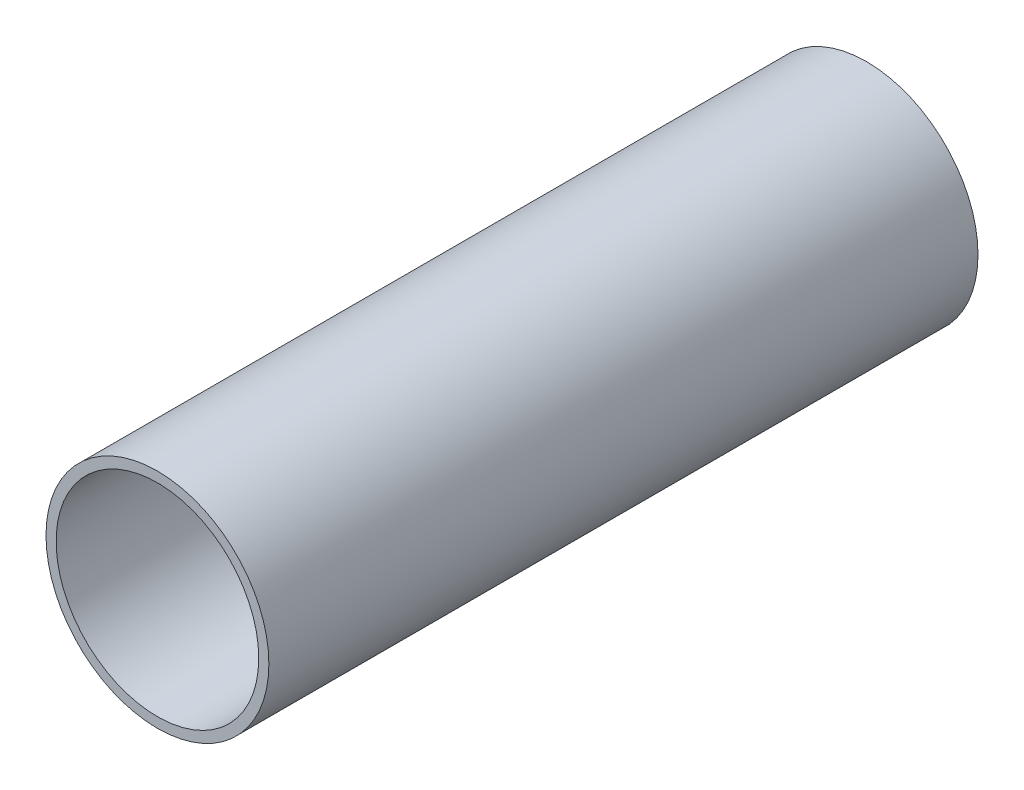
ISO-10303-21;
HEADER;
FILE_DESCRIPTION(('STEP AP214'),'2;1');
FILE_NAME('part.step','',(''),(''),'','','');
FILE_SCHEMA(('AUTOMOTIVE_DESIGN { 1 0 10303 214 1 1 1 1 }'));
ENDSEC;
DATA;
#1=APPLICATION_CONTEXT('core data for automotive mechanical design processes');
#2=APPLICATION_PROTOCOL_DEFINITION('international standard','automotive_design',2000,#1);
#3=PRODUCT_CONTEXT('',#1,'mechanical');
#4=PRODUCT('Part','Part','',(#3));
#5=PRODUCT_RELATED_PRODUCT_CATEGORY('part','',(#4));
#6=PRODUCT_DEFINITION_FORMATION('','',#4);
#7=PRODUCT_DEFINITION_CONTEXT('part definition',#1,'design');
#8=PRODUCT_DEFINITION('design','',#6,#7);
#9=PRODUCT_DEFINITION_SHAPE('','',#8);
#10=(LENGTH_UNIT() NAMED_UNIT(*) SI_UNIT(.MILLI.,.METRE.));
#11=(NAMED_UNIT(*) PLANE_ANGLE_UNIT() SI_UNIT($,.RADIAN.));
#12=(NAMED_UNIT(*) SI_UNIT($,.STERADIAN.) SOLID_ANGLE_UNIT());
#13=UNCERTAINTY_MEASURE_WITH_UNIT(LENGTH_MEASURE(1.E-05),#10,'distance_accuracy_value','');
#14=(GEOMETRIC_REPRESENTATION_CONTEXT(3) GLOBAL_UNCERTAINTY_ASSIGNED_CONTEXT((#13)) GLOBAL_UNIT_ASSIGNED_CONTEXT((#10,
#11,#12)) REPRESENTATION_CONTEXT('',''));
#15=CARTESIAN_POINT('',(0.,0.,0.));
#16=DIRECTION('',(0.,0.,1.));
#17=DIRECTION('',(1.,0.,0.));
#18=AXIS2_PLACEMENT_3D('',#15,#16,#17);
#19=CARTESIAN_POINT('',(0.,0.,70.));
#20=DIRECTION('',(0.,0.,1.));
#21=DIRECTION('',(1.,0.,0.));
#22=AXIS2_PLACEMENT_3D('',#19,#20,#21);
#23=PLANE('',#22);
#24=CARTESIAN_POINT('',(0.,0.,70.));
#25=DIRECTION('',(0.,0.,1.));
#26=DIRECTION('',(1.,0.,0.));
#27=AXIS2_PLACEMENT_3D('',#24,#25,#26);
#28=CIRCLE('',#27,11.);
#29=CARTESIAN_POINT('',(11.,0.,70.));
#30=VERTEX_POINT('',#29);
#31=EDGE_CURVE('E10',#30,#30,#28,.T.);
#32=ORIENTED_EDGE('',*,*,#31,.T.);
#33=EDGE_LOOP('',(#32));
#34=FACE_BOUND('',#33,.T.);
#35=CARTESIAN_POINT('',(0.,0.,70.));
#36=DIRECTION('',(0.,0.,1.));
#37=DIRECTION('',(1.,0.,0.));
#38=AXIS2_PLACEMENT_3D('',#35,#36,#37);
#39=CIRCLE('',#38,10.);
#40=CARTESIAN_POINT('',(10.,0.,70.));
#41=VERTEX_POINT('',#40);
#42=EDGE_CURVE('E46',#41,#41,#39,.T.);
#43=ORIENTED_EDGE('',*,*,#42,.F.);
#44=EDGE_LOOP('',(#43));
#45=FACE_BOUND('',#44,.T.);
#46=ADVANCED_FACE('F35',(#34,#45),#23,.T.);
#47=CARTESIAN_POINT('',(0.,0.,0.));
#48=DIRECTION('',(0.,0.,1.));
#49=DIRECTION('',(1.,0.,0.));
#50=AXIS2_PLACEMENT_3D('',#47,#48,#49);
#51=PLANE('',#50);
#52=CARTESIAN_POINT('',(0.,0.,0.));
#53=DIRECTION('',(0.,0.,1.));
#54=DIRECTION('',(1.,0.,0.));
#55=AXIS2_PLACEMENT_3D('',#52,#53,#54);
#56=CIRCLE('',#55,11.);
#57=CARTESIAN_POINT('',(11.,0.,0.));
#58=VERTEX_POINT('',#57);
#59=EDGE_CURVE('E39',#58,#58,#56,.T.);
#60=ORIENTED_EDGE('',*,*,#59,.F.);
#61=EDGE_LOOP('',(#60));
#62=FACE_BOUND('',#61,.T.);
#63=CARTESIAN_POINT('',(0.,0.,0.));
#64=DIRECTION('',(0.,0.,1.));
#65=DIRECTION('',(1.,0.,0.));
#66=AXIS2_PLACEMENT_3D('',#63,#64,#65);
#67=CIRCLE('',#66,10.);
#68=CARTESIAN_POINT('',(10.,0.,0.));
#69=VERTEX_POINT('',#68);
#70=EDGE_CURVE('E48',#69,#69,#67,.T.);
#71=ORIENTED_EDGE('',*,*,#70,.T.);
#72=EDGE_LOOP('',(#71));
#73=FACE_BOUND('',#72,.T.);
#74=ADVANCED_FACE('F58',(#62,#73),#51,.F.);
#75=CARTESIAN_POINT('',(0.,0.,70.));
#76=DIRECTION('',(0.,0.,-1.));
#77=DIRECTION('',(-1.,0.,0.));
#78=AXIS2_PLACEMENT_3D('',#75,#76,#77);
#79=CYLINDRICAL_SURFACE('',#78,11.);
#80=ORIENTED_EDGE('',*,*,#31,.F.);
#81=EDGE_LOOP('',(#80));
#82=FACE_BOUND('',#81,.T.);
#83=ORIENTED_EDGE('',*,*,#59,.T.);
#84=EDGE_LOOP('',(#83));
#85=FACE_BOUND('',#84,.T.);
#86=ADVANCED_FACE('F37',(#82,#85),#79,.T.);
#87=CARTESIAN_POINT('',(0.,0.,70.));
#88=DIRECTION('',(0.,0.,-1.));
#89=DIRECTION('',(-1.,0.,0.));
#90=AXIS2_PLACEMENT_3D('',#87,#88,#89);
#91=CYLINDRICAL_SURFACE('',#90,10.);
#92=ORIENTED_EDGE('',*,*,#42,.T.);
#93=EDGE_LOOP('',(#92));
#94=FACE_BOUND('',#93,.T.);
#95=ORIENTED_EDGE('',*,*,#70,.F.);
#96=EDGE_LOOP('',(#95));
#97=FACE_BOUND('',#96,.T.);
#98=ADVANCED_FACE('F54',(#94,#97),#91,.F.);
#99=CLOSED_SHELL('',(#46,#74,#86,#98));
#100=MANIFOLD_SOLID_BREP('B2',#99);
#101=ADVANCED_BREP_SHAPE_REPRESENTATION('',(#18,#100),#14);
#102=SHAPE_DEFINITION_REPRESENTATION(#9,#101);
ENDSEC;
END-ISO-10303-21;
